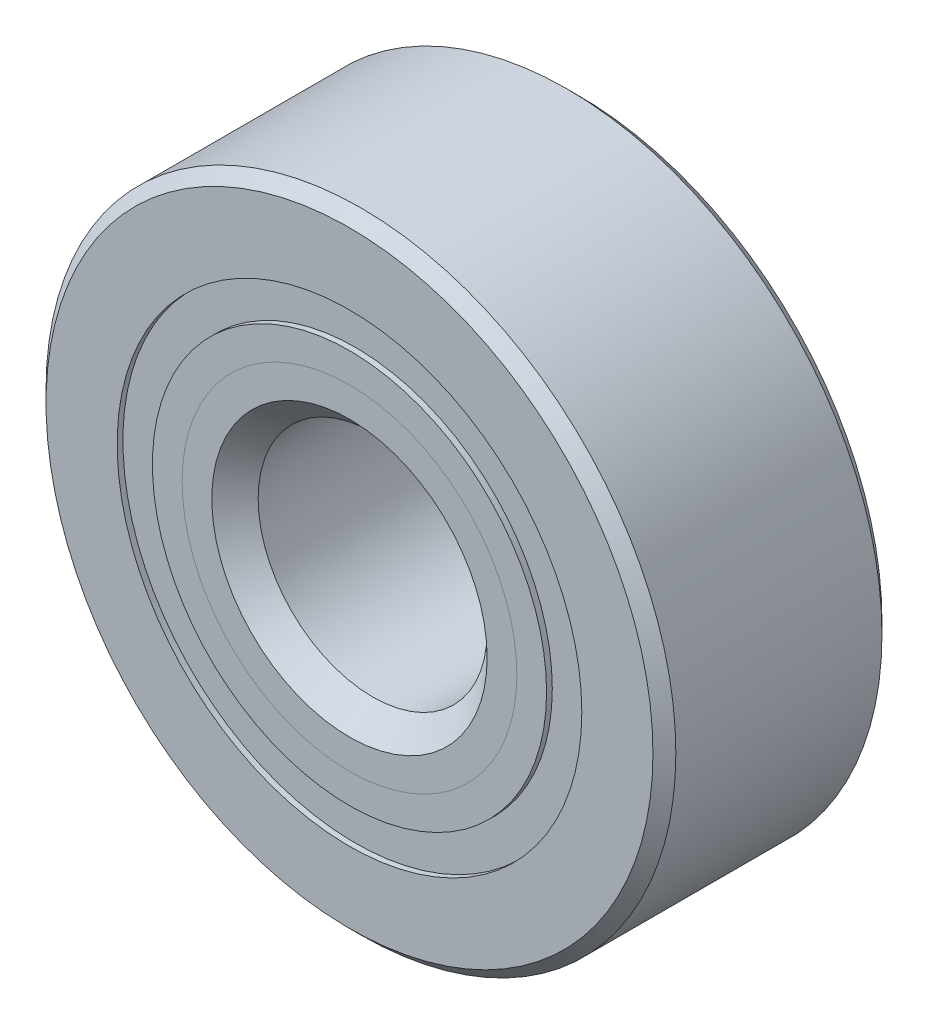
ISO-10303-21;
HEADER;
FILE_DESCRIPTION(('STEP AP214'),'2;1');
FILE_NAME('part.step','',(''),(''),'','','');
FILE_SCHEMA(('AUTOMOTIVE_DESIGN { 1 0 10303 214 1 1 1 1 }'));
ENDSEC;
DATA;
#1=APPLICATION_CONTEXT('core data for automotive mechanical design processes');
#2=APPLICATION_PROTOCOL_DEFINITION('international standard','automotive_design',2000,#1);
#3=PRODUCT_CONTEXT('',#1,'mechanical');
#4=PRODUCT('Part','Part','',(#3));
#5=PRODUCT_RELATED_PRODUCT_CATEGORY('part','',(#4));
#6=PRODUCT_DEFINITION_FORMATION('','',#4);
#7=PRODUCT_DEFINITION_CONTEXT('part definition',#1,'design');
#8=PRODUCT_DEFINITION('design','',#6,#7);
#9=PRODUCT_DEFINITION_SHAPE('','',#8);
#10=(LENGTH_UNIT() NAMED_UNIT(*) SI_UNIT(.MILLI.,.METRE.));
#11=(NAMED_UNIT(*) PLANE_ANGLE_UNIT() SI_UNIT($,.RADIAN.));
#12=(NAMED_UNIT(*) SI_UNIT($,.STERADIAN.) SOLID_ANGLE_UNIT());
#13=UNCERTAINTY_MEASURE_WITH_UNIT(LENGTH_MEASURE(1.E-05),#10,'distance_accuracy_value','');
#14=(GEOMETRIC_REPRESENTATION_CONTEXT(3) GLOBAL_UNCERTAINTY_ASSIGNED_CONTEXT((#13)) GLOBAL_UNIT_ASSIGNED_CONTEXT((#10,
#11,#12)) REPRESENTATION_CONTEXT('',''));
#15=CARTESIAN_POINT('',(0.,0.,0.));
#16=DIRECTION('',(0.,0.,1.));
#17=DIRECTION('',(1.,0.,0.));
#18=AXIS2_PLACEMENT_3D('',#15,#16,#17);
#19=CARTESIAN_POINT('',(0.,6.44158653846154,-3.01625000000001));
#20=DIRECTION('',(0.,0.,1.));
#21=DIRECTION('',(1.,0.,0.));
#22=AXIS2_PLACEMENT_3D('',#19,#20,#21);
#23=PLANE('',#22);
#24=CARTESIAN_POINT('',(0.,0.,-3.01625000000001));
#25=DIRECTION('',(0.,0.,1.));
#26=DIRECTION('',(1.,0.,0.));
#27=AXIS2_PLACEMENT_3D('',#24,#25,#26);
#28=CIRCLE('',#27,6.44158653846154);
#29=CARTESIAN_POINT('',(6.44158653846154,0.,-3.01625000000001));
#30=VERTEX_POINT('',#29);
#31=EDGE_CURVE('E57',#30,#30,#28,.T.);
#32=ORIENTED_EDGE('',*,*,#31,.F.);
#33=EDGE_LOOP('',(#32));
#34=FACE_BOUND('',#33,.T.);
#35=CARTESIAN_POINT('',(0.,0.,-3.01625000000001));
#36=DIRECTION('',(0.,0.,1.));
#37=DIRECTION('',(1.,0.,0.));
#38=AXIS2_PLACEMENT_3D('',#35,#36,#37);
#39=CIRCLE('',#38,5.46466346153846);
#40=CARTESIAN_POINT('',(5.46466346153846,0.,-3.01625000000001));
#41=VERTEX_POINT('',#40);
#42=EDGE_CURVE('E11',#41,#41,#39,.T.);
#43=ORIENTED_EDGE('',*,*,#42,.T.);
#44=EDGE_LOOP('',(#43));
#45=FACE_BOUND('',#44,.T.);
#46=ADVANCED_FACE('F43',(#34,#45),#23,.F.);
#47=CARTESIAN_POINT('',(0.,0.,3.175));
#48=DIRECTION('',(0.,0.,1.));
#49=DIRECTION('',(1.,0.,0.));
#50=AXIS2_PLACEMENT_3D('',#47,#48,#49);
#51=CYLINDRICAL_SURFACE('',#50,5.46466346153846);
#52=ORIENTED_EDGE('',*,*,#42,.F.);
#53=EDGE_LOOP('',(#52));
#54=FACE_BOUND('',#53,.T.);
#55=CARTESIAN_POINT('',(0.,0.,-1.4932612773582));
#56=DIRECTION('',(0.,0.,1.));
#57=DIRECTION('',(1.,0.,0.));
#58=AXIS2_PLACEMENT_3D('',#55,#56,#57);
#59=CIRCLE('',#58,5.46466346153846);
#60=CARTESIAN_POINT('',(5.46466346153846,0.,-1.4932612773582));
#61=VERTEX_POINT('',#60);
#62=EDGE_CURVE('E49',#61,#61,#59,.T.);
#63=ORIENTED_EDGE('',*,*,#62,.T.);
#64=EDGE_LOOP('',(#63));
#65=FACE_BOUND('',#64,.T.);
#66=ADVANCED_FACE('F66',(#54,#65),#51,.F.);
#67=CARTESIAN_POINT('',(0.,6.44158653846153,-1.4932612773582));
#68=DIRECTION('',(0.,0.,-1.));
#69=DIRECTION('',(-1.,0.,0.));
#70=AXIS2_PLACEMENT_3D('',#67,#68,#69);
#71=PLANE('',#70);
#72=ORIENTED_EDGE('',*,*,#62,.F.);
#73=EDGE_LOOP('',(#72));
#74=FACE_BOUND('',#73,.T.);
#75=CARTESIAN_POINT('',(0.,0.,-1.4932612773582));
#76=DIRECTION('',(0.,0.,1.));
#77=DIRECTION('',(1.,0.,0.));
#78=AXIS2_PLACEMENT_3D('',#75,#76,#77);
#79=CIRCLE('',#78,6.44158653846153);
#80=CARTESIAN_POINT('',(6.44158653846153,0.,-1.4932612773582));
#81=VERTEX_POINT('',#80);
#82=EDGE_CURVE('E53',#81,#81,#79,.T.);
#83=ORIENTED_EDGE('',*,*,#82,.T.);
#84=EDGE_LOOP('',(#83));
#85=FACE_BOUND('',#84,.T.);
#86=ADVANCED_FACE('F70',(#74,#85),#71,.F.);
#87=CARTESIAN_POINT('',(0.,0.,3.175));
#88=DIRECTION('',(0.,0.,1.));
#89=DIRECTION('',(1.,0.,0.));
#90=AXIS2_PLACEMENT_3D('',#87,#88,#89);
#91=CYLINDRICAL_SURFACE('',#90,6.44158653846154);
#92=ORIENTED_EDGE('',*,*,#82,.F.);
#93=EDGE_LOOP('',(#92));
#94=FACE_BOUND('',#93,.T.);
#95=ORIENTED_EDGE('',*,*,#31,.T.);
#96=EDGE_LOOP('',(#95));
#97=FACE_BOUND('',#96,.T.);
#98=ADVANCED_FACE('F63',(#94,#97),#91,.T.);
#99=CLOSED_SHELL('',(#46,#66,#86,#98));
#100=MANIFOLD_SOLID_BREP('B2',#99);
#101=CARTESIAN_POINT('',(0.,6.44158653846153,3.01625));
#102=DIRECTION('',(0.,0.,-1.));
#103=DIRECTION('',(-1.,0.,0.));
#104=AXIS2_PLACEMENT_3D('',#101,#102,#103);
#105=PLANE('',#104);
#106=CARTESIAN_POINT('',(0.,0.,3.01625));
#107=DIRECTION('',(0.,0.,1.));
#108=DIRECTION('',(1.,0.,0.));
#109=AXIS2_PLACEMENT_3D('',#106,#107,#108);
#110=CIRCLE('',#109,5.46466346153846);
#111=CARTESIAN_POINT('',(5.46466346153846,0.,3.01625));
#112=VERTEX_POINT('',#111);
#113=EDGE_CURVE('E42',#112,#112,#110,.T.);
#114=ORIENTED_EDGE('',*,*,#113,.F.);
#115=EDGE_LOOP('',(#114));
#116=FACE_BOUND('',#115,.T.);
#117=CARTESIAN_POINT('',(0.,0.,3.01625));
#118=DIRECTION('',(0.,0.,1.));
#119=DIRECTION('',(1.,0.,0.));
#120=AXIS2_PLACEMENT_3D('',#117,#118,#119);
#121=CIRCLE('',#120,6.44158653846153);
#122=CARTESIAN_POINT('',(6.44158653846153,0.,3.01625));
#123=VERTEX_POINT('',#122);
#124=EDGE_CURVE('E124',#123,#123,#121,.T.);
#125=ORIENTED_EDGE('',*,*,#124,.T.);
#126=EDGE_LOOP('',(#125));
#127=FACE_BOUND('',#126,.T.);
#128=ADVANCED_FACE('F110',(#116,#127),#105,.F.);
#129=CARTESIAN_POINT('',(0.,0.,3.175));
#130=DIRECTION('',(0.,0.,1.));
#131=DIRECTION('',(1.,0.,0.));
#132=AXIS2_PLACEMENT_3D('',#129,#130,#131);
#133=CYLINDRICAL_SURFACE('',#132,5.46466346153846);
#134=CARTESIAN_POINT('',(0.,0.,1.4932612773582));
#135=DIRECTION('',(0.,0.,1.));
#136=DIRECTION('',(1.,0.,0.));
#137=AXIS2_PLACEMENT_3D('',#134,#135,#136);
#138=CIRCLE('',#137,5.46466346153846);
#139=CARTESIAN_POINT('',(5.46466346153846,0.,1.4932612773582));
#140=VERTEX_POINT('',#139);
#141=EDGE_CURVE('E116',#140,#140,#138,.T.);
#142=ORIENTED_EDGE('',*,*,#141,.F.);
#143=EDGE_LOOP('',(#142));
#144=FACE_BOUND('',#143,.T.);
#145=ORIENTED_EDGE('',*,*,#113,.T.);
#146=EDGE_LOOP('',(#145));
#147=FACE_BOUND('',#146,.T.);
#148=ADVANCED_FACE('F139',(#144,#147),#133,.F.);
#149=CARTESIAN_POINT('',(0.,6.44158653846153,1.4932612773582));
#150=DIRECTION('',(0.,0.,1.));
#151=DIRECTION('',(1.,0.,0.));
#152=AXIS2_PLACEMENT_3D('',#149,#150,#151);
#153=PLANE('',#152);
#154=CARTESIAN_POINT('',(0.,0.,1.4932612773582));
#155=DIRECTION('',(0.,0.,1.));
#156=DIRECTION('',(1.,0.,0.));
#157=AXIS2_PLACEMENT_3D('',#154,#155,#156);
#158=CIRCLE('',#157,6.44158653846153);
#159=CARTESIAN_POINT('',(6.44158653846153,0.,1.4932612773582));
#160=VERTEX_POINT('',#159);
#161=EDGE_CURVE('E120',#160,#160,#158,.T.);
#162=ORIENTED_EDGE('',*,*,#161,.F.);
#163=EDGE_LOOP('',(#162));
#164=FACE_BOUND('',#163,.T.);
#165=ORIENTED_EDGE('',*,*,#141,.T.);
#166=EDGE_LOOP('',(#165));
#167=FACE_BOUND('',#166,.T.);
#168=ADVANCED_FACE('F134',(#164,#167),#153,.F.);
#169=CARTESIAN_POINT('',(0.,0.,3.175));
#170=DIRECTION('',(0.,0.,1.));
#171=DIRECTION('',(1.,0.,0.));
#172=AXIS2_PLACEMENT_3D('',#169,#170,#171);
#173=CYLINDRICAL_SURFACE('',#172,6.44158653846153);
#174=ORIENTED_EDGE('',*,*,#124,.F.);
#175=EDGE_LOOP('',(#174));
#176=FACE_BOUND('',#175,.T.);
#177=ORIENTED_EDGE('',*,*,#161,.T.);
#178=EDGE_LOOP('',(#177));
#179=FACE_BOUND('',#178,.T.);
#180=ADVANCED_FACE('F131',(#176,#179),#173,.T.);
#181=CLOSED_SHELL('',(#128,#148,#168,#180));
#182=MANIFOLD_SOLID_BREP('B6',#181);
#183=CARTESIAN_POINT('',(-4.20949505675111,4.20949505675122,0.));
#184=DIRECTION('',(0.,0.,1.));
#185=DIRECTION('',(-0.707106781186539,0.707106781186556,0.));
#186=AXIS2_PLACEMENT_3D('',#183,#184,#185);
#187=SPHERICAL_SURFACE('',#186,1.4932612773582);
#188=CARTESIAN_POINT('',(-4.20949505675111,4.20949505675122,1.4932612773582));
#189=VERTEX_POINT('',#188);
#190=VERTEX_LOOP('',#189);
#191=FACE_BOUND('',#190,.T.);
#192=ADVANCED_FACE('F177',(#191),#187,.T.);
#193=CLOSED_SHELL('',(#192));
#194=MANIFOLD_SOLID_BREP('B37',#193);
#195=CARTESIAN_POINT('',(-5.953125,0.,0.));
#196=DIRECTION('',(0.,0.,1.));
#197=DIRECTION('',(-1.,0.,0.));
#198=AXIS2_PLACEMENT_3D('',#195,#196,#197);
#199=SPHERICAL_SURFACE('',#198,1.4932612773582);
#200=CARTESIAN_POINT('',(-5.953125,0.,1.4932612773582));
#201=VERTEX_POINT('',#200);
#202=VERTEX_LOOP('',#201);
#203=FACE_BOUND('',#202,.T.);
#204=ADVANCED_FACE('F210',(#203),#199,.T.);
#205=CLOSED_SHELL('',(#204));
#206=MANIFOLD_SOLID_BREP('B106',#205);
#207=CARTESIAN_POINT('',(-4.2094950567512,-4.20949505675113,0.));
#208=DIRECTION('',(0.,0.,1.));
#209=DIRECTION('',(-0.707106781186554,-0.707106781186541,0.));
#210=AXIS2_PLACEMENT_3D('',#207,#208,#209);
#211=SPHERICAL_SURFACE('',#210,1.4932612773582);
#212=CARTESIAN_POINT('',(-4.2094950567512,-4.20949505675113,1.4932612773582));
#213=VERTEX_POINT('',#212);
#214=VERTEX_LOOP('',#213);
#215=FACE_BOUND('',#214,.T.);
#216=ADVANCED_FACE('F243',(#215),#211,.T.);
#217=CLOSED_SHELL('',(#216));
#218=MANIFOLD_SOLID_BREP('B173',#217);
#219=CARTESIAN_POINT('',(0.,-5.953125,0.));
#220=DIRECTION('',(0.,0.,1.));
#221=DIRECTION('',(0.,-1.,0.));
#222=AXIS2_PLACEMENT_3D('',#219,#220,#221);
#223=SPHERICAL_SURFACE('',#222,1.4932612773582);
#224=CARTESIAN_POINT('',(0.,-5.953125,1.4932612773582));
#225=VERTEX_POINT('',#224);
#226=VERTEX_LOOP('',#225);
#227=FACE_BOUND('',#226,.T.);
#228=ADVANCED_FACE('F274',(#227),#223,.T.);
#229=CLOSED_SHELL('',(#228));
#230=MANIFOLD_SOLID_BREP('B206',#229);
#231=CARTESIAN_POINT('',(4.20949505675114,-4.20949505675119,0.));
#232=DIRECTION('',(0.,0.,1.));
#233=DIRECTION('',(0.707106781186544,-0.707106781186551,0.));
#234=AXIS2_PLACEMENT_3D('',#231,#232,#233);
#235=SPHERICAL_SURFACE('',#234,1.4932612773582);
#236=CARTESIAN_POINT('',(4.20949505675114,-4.20949505675119,1.4932612773582));
#237=VERTEX_POINT('',#236);
#238=VERTEX_LOOP('',#237);
#239=FACE_BOUND('',#238,.T.);
#240=ADVANCED_FACE('F307',(#239),#235,.T.);
#241=CLOSED_SHELL('',(#240));
#242=MANIFOLD_SOLID_BREP('B239',#241);
#243=CARTESIAN_POINT('',(5.953125,0.,0.));
#244=DIRECTION('',(0.,0.,1.));
#245=DIRECTION('',(1.,0.,0.));
#246=AXIS2_PLACEMENT_3D('',#243,#244,#245);
#247=SPHERICAL_SURFACE('',#246,1.4932612773582);
#248=CARTESIAN_POINT('',(5.953125,0.,1.4932612773582));
#249=VERTEX_POINT('',#248);
#250=VERTEX_LOOP('',#249);
#251=FACE_BOUND('',#250,.T.);
#252=ADVANCED_FACE('F340',(#251),#247,.T.);
#253=CLOSED_SHELL('',(#252));
#254=MANIFOLD_SOLID_BREP('B270',#253);
#255=CARTESIAN_POINT('',(4.20949505675117,4.20949505675116,0.));
#256=DIRECTION('',(0.,0.,1.));
#257=DIRECTION('',(0.707106781186549,0.707106781186546,0.));
#258=AXIS2_PLACEMENT_3D('',#255,#256,#257);
#259=SPHERICAL_SURFACE('',#258,1.4932612773582);
#260=CARTESIAN_POINT('',(4.20949505675117,4.20949505675116,1.4932612773582));
#261=VERTEX_POINT('',#260);
#262=VERTEX_LOOP('',#261);
#263=FACE_BOUND('',#262,.T.);
#264=ADVANCED_FACE('F373',(#263),#259,.T.);
#265=CLOSED_SHELL('',(#264));
#266=MANIFOLD_SOLID_BREP('B303',#265);
#267=CARTESIAN_POINT('',(0.,5.953125,0.));
#268=DIRECTION('',(0.,0.,1.));
#269=DIRECTION('',(0.,1.,0.));
#270=AXIS2_PLACEMENT_3D('',#267,#268,#269);
#271=SPHERICAL_SURFACE('',#270,1.4932612773582);
#272=CARTESIAN_POINT('',(0.,5.953125,1.4932612773582));
#273=VERTEX_POINT('',#272);
#274=VERTEX_LOOP('',#273);
#275=FACE_BOUND('',#274,.T.);
#276=ADVANCED_FACE('F406',(#275),#271,.T.);
#277=CLOSED_SHELL('',(#276));
#278=MANIFOLD_SOLID_BREP('B336',#277);
#279=CARTESIAN_POINT('',(0.,4.64104766142968,3.175));
#280=DIRECTION('',(0.,0.,-1.));
#281=DIRECTION('',(-1.,0.,0.));
#282=AXIS2_PLACEMENT_3D('',#279,#280,#281);
#283=PLANE('',#282);
#284=CARTESIAN_POINT('',(0.,0.,3.175));
#285=DIRECTION('',(0.,0.,1.));
#286=DIRECTION('',(1.,0.,0.));
#287=AXIS2_PLACEMENT_3D('',#284,#285,#286);
#288=CIRCLE('',#287,3.8174318613209);
#289=CARTESIAN_POINT('',(3.8174318613209,0.,3.175));
#290=VERTEX_POINT('',#289);
#291=EDGE_CURVE('E460',#290,#290,#288,.T.);
#292=ORIENTED_EDGE('',*,*,#291,.F.);
#293=EDGE_LOOP('',(#292));
#294=FACE_BOUND('',#293,.T.);
#295=CARTESIAN_POINT('',(0.,0.,3.175));
#296=DIRECTION('',(0.,0.,1.));
#297=DIRECTION('',(1.,0.,0.));
#298=AXIS2_PLACEMENT_3D('',#295,#296,#297);
#299=CIRCLE('',#298,4.64104766142968);
#300=CARTESIAN_POINT('',(4.64104766142968,0.,3.175));
#301=VERTEX_POINT('',#300);
#302=EDGE_CURVE('E405',#301,#301,#299,.T.);
#303=ORIENTED_EDGE('',*,*,#302,.T.);
#304=EDGE_LOOP('',(#303));
#305=FACE_BOUND('',#304,.T.);
#306=ADVANCED_FACE('F426',(#294,#305),#283,.F.);
#307=CARTESIAN_POINT('',(0.,0.,2.35138419989122));
#308=DIRECTION('',(0.,0.,1.));
#309=DIRECTION('',(1.,0.,0.));
#310=AXIS2_PLACEMENT_3D('',#307,#308,#309);
#311=CONICAL_SURFACE('',#310,3.8174318613209,0.78539816339745);
#312=ORIENTED_EDGE('',*,*,#302,.F.);
#313=EDGE_LOOP('',(#312));
#314=FACE_BOUND('',#313,.T.);
#315=CARTESIAN_POINT('',(0.,0.,2.35138419989122));
#316=DIRECTION('',(0.,0.,1.));
#317=DIRECTION('',(1.,0.,0.));
#318=AXIS2_PLACEMENT_3D('',#315,#316,#317);
#319=CIRCLE('',#318,3.8174318613209);
#320=CARTESIAN_POINT('',(3.8174318613209,0.,2.35138419989122));
#321=VERTEX_POINT('',#320);
#322=EDGE_CURVE('E432',#321,#321,#319,.T.);
#323=ORIENTED_EDGE('',*,*,#322,.T.);
#324=EDGE_LOOP('',(#323));
#325=FACE_BOUND('',#324,.T.);
#326=ADVANCED_FACE('F467',(#314,#325),#311,.T.);
#327=CARTESIAN_POINT('',(0.,0.,3.175));
#328=DIRECTION('',(0.,0.,1.));
#329=DIRECTION('',(1.,0.,0.));
#330=AXIS2_PLACEMENT_3D('',#327,#328,#329);
#331=CYLINDRICAL_SURFACE('',#330,3.8174318613209);
#332=ORIENTED_EDGE('',*,*,#322,.F.);
#333=EDGE_LOOP('',(#332));
#334=FACE_BOUND('',#333,.T.);
#335=CARTESIAN_POINT('',(0.,0.,0.));
#336=DIRECTION('',(0.,0.,1.));
#337=DIRECTION('',(1.,0.,0.));
#338=AXIS2_PLACEMENT_3D('',#335,#336,#337);
#339=CIRCLE('',#338,3.8174318613209);
#340=CARTESIAN_POINT('',(3.8174318613209,0.,0.));
#341=VERTEX_POINT('',#340);
#342=EDGE_CURVE('E436',#341,#341,#339,.T.);
#343=ORIENTED_EDGE('',*,*,#342,.T.);
#344=EDGE_LOOP('',(#343));
#345=FACE_BOUND('',#344,.T.);
#346=ADVANCED_FACE('F471',(#334,#345),#331,.T.);
#347=CARTESIAN_POINT('',(0.,3.8174318613209,0.));
#348=DIRECTION('',(0.,0.,-1.));
#349=DIRECTION('',(-1.,0.,0.));
#350=AXIS2_PLACEMENT_3D('',#347,#348,#349);
#351=PLANE('',#350);
#352=ORIENTED_EDGE('',*,*,#342,.F.);
#353=EDGE_LOOP('',(#352));
#354=FACE_BOUND('',#353,.T.);
#355=CARTESIAN_POINT('',(0.,0.,0.));
#356=DIRECTION('',(0.,0.,1.));
#357=DIRECTION('',(1.,0.,0.));
#358=AXIS2_PLACEMENT_3D('',#355,#356,#357);
#359=CIRCLE('',#358,4.4598637226418);
#360=CARTESIAN_POINT('',(4.4598637226418,0.,0.));
#361=VERTEX_POINT('',#360);
#362=EDGE_CURVE('E440',#361,#361,#359,.T.);
#363=ORIENTED_EDGE('',*,*,#362,.T.);
#364=EDGE_LOOP('',(#363));
#365=FACE_BOUND('',#364,.T.);
#366=ADVANCED_FACE('F476',(#354,#365),#351,.F.);
#367=CARTESIAN_POINT('',(0.,0.,0.));
#368=DIRECTION('',(0.,0.,1.));
#369=DIRECTION('',(1.,0.,0.));
#370=AXIS2_PLACEMENT_3D('',#367,#368,#369);
#371=TOROIDAL_SURFACE('',#370,5.953125,1.4932612773582);
#372=ORIENTED_EDGE('',*,*,#362,.F.);
#373=EDGE_LOOP('',(#372));
#374=FACE_BOUND('',#373,.T.);
#375=CARTESIAN_POINT('',(0.,0.,-1.41111111111111));
#376=DIRECTION('',(0.,0.,1.));
#377=DIRECTION('',(1.,0.,0.));
#378=AXIS2_PLACEMENT_3D('',#375,#376,#377);
#379=CIRCLE('',#378,5.46466346153846);
#380=CARTESIAN_POINT('',(5.46466346153846,0.,-1.41111111111111));
#381=VERTEX_POINT('',#380);
#382=EDGE_CURVE('E445',#381,#381,#379,.T.);
#383=ORIENTED_EDGE('',*,*,#382,.T.);
#384=EDGE_LOOP('',(#383));
#385=FACE_BOUND('',#384,.T.);
#386=ADVANCED_FACE('F482',(#374,#385),#371,.F.);
#387=CARTESIAN_POINT('',(0.,0.,3.175));
#388=DIRECTION('',(0.,0.,1.));
#389=DIRECTION('',(1.,0.,0.));
#390=AXIS2_PLACEMENT_3D('',#387,#388,#389);
#391=CYLINDRICAL_SURFACE('',#390,5.46466346153846);
#392=ORIENTED_EDGE('',*,*,#382,.F.);
#393=EDGE_LOOP('',(#392));
#394=FACE_BOUND('',#393,.T.);
#395=CARTESIAN_POINT('',(0.,0.,-3.175));
#396=DIRECTION('',(0.,0.,1.));
#397=DIRECTION('',(1.,0.,0.));
#398=AXIS2_PLACEMENT_3D('',#395,#396,#397);
#399=CIRCLE('',#398,5.46466346153846);
#400=CARTESIAN_POINT('',(5.46466346153846,0.,-3.175));
#401=VERTEX_POINT('',#400);
#402=EDGE_CURVE('E448',#401,#401,#399,.T.);
#403=ORIENTED_EDGE('',*,*,#402,.T.);
#404=EDGE_LOOP('',(#403));
#405=FACE_BOUND('',#404,.T.);
#406=ADVANCED_FACE('F486',(#394,#405),#391,.T.);
#407=CARTESIAN_POINT('',(0.,3.4925,-3.175));
#408=DIRECTION('',(0.,0.,1.));
#409=DIRECTION('',(1.,0.,0.));
#410=AXIS2_PLACEMENT_3D('',#407,#408,#409);
#411=PLANE('',#410);
#412=ORIENTED_EDGE('',*,*,#402,.F.);
#413=EDGE_LOOP('',(#412));
#414=FACE_BOUND('',#413,.T.);
#415=CARTESIAN_POINT('',(0.,0.,-3.175));
#416=DIRECTION('',(0.,0.,1.));
#417=DIRECTION('',(1.,0.,0.));
#418=AXIS2_PLACEMENT_3D('',#415,#416,#417);
#419=CIRCLE('',#418,3.4925);
#420=CARTESIAN_POINT('',(3.4925,0.,-3.175));
#421=VERTEX_POINT('',#420);
#422=EDGE_CURVE('E451',#421,#421,#419,.T.);
#423=ORIENTED_EDGE('',*,*,#422,.T.);
#424=EDGE_LOOP('',(#423));
#425=FACE_BOUND('',#424,.T.);
#426=ADVANCED_FACE('F490',(#414,#425),#411,.F.);
#427=CARTESIAN_POINT('',(0.,0.,-2.8575));
#428=DIRECTION('',(0.,0.,-1.));
#429=DIRECTION('',(-1.,0.,0.));
#430=AXIS2_PLACEMENT_3D('',#427,#428,#429);
#431=CONICAL_SURFACE('',#430,3.175,0.78539816339745);
#432=ORIENTED_EDGE('',*,*,#422,.F.);
#433=EDGE_LOOP('',(#432));
#434=FACE_BOUND('',#433,.T.);
#435=CARTESIAN_POINT('',(0.,0.,-2.8575));
#436=DIRECTION('',(0.,0.,1.));
#437=DIRECTION('',(1.,0.,0.));
#438=AXIS2_PLACEMENT_3D('',#435,#436,#437);
#439=CIRCLE('',#438,3.175);
#440=CARTESIAN_POINT('',(3.175,0.,-2.8575));
#441=VERTEX_POINT('',#440);
#442=EDGE_CURVE('E454',#441,#441,#439,.T.);
#443=ORIENTED_EDGE('',*,*,#442,.T.);
#444=EDGE_LOOP('',(#443));
#445=FACE_BOUND('',#444,.T.);
#446=ADVANCED_FACE('F494',(#434,#445),#431,.F.);
#447=CARTESIAN_POINT('',(0.,0.,3.175));
#448=DIRECTION('',(0.,0.,1.));
#449=DIRECTION('',(1.,0.,0.));
#450=AXIS2_PLACEMENT_3D('',#447,#448,#449);
#451=CYLINDRICAL_SURFACE('',#450,3.175);
#452=ORIENTED_EDGE('',*,*,#442,.F.);
#453=EDGE_LOOP('',(#452));
#454=FACE_BOUND('',#453,.T.);
#455=CARTESIAN_POINT('',(0.,0.,2.5325681386791));
#456=DIRECTION('',(0.,0.,1.));
#457=DIRECTION('',(1.,0.,0.));
#458=AXIS2_PLACEMENT_3D('',#455,#456,#457);
#459=CIRCLE('',#458,3.175);
#460=CARTESIAN_POINT('',(3.175,0.,2.5325681386791));
#461=VERTEX_POINT('',#460);
#462=EDGE_CURVE('E457',#461,#461,#459,.T.);
#463=ORIENTED_EDGE('',*,*,#462,.T.);
#464=EDGE_LOOP('',(#463));
#465=FACE_BOUND('',#464,.T.);
#466=ADVANCED_FACE('F498',(#454,#465),#451,.F.);
#467=CARTESIAN_POINT('',(0.,0.,3.175));
#468=DIRECTION('',(0.,0.,1.));
#469=DIRECTION('',(1.,0.,0.));
#470=AXIS2_PLACEMENT_3D('',#467,#468,#469);
#471=CONICAL_SURFACE('',#470,3.8174318613209,0.78539816339745);
#472=ORIENTED_EDGE('',*,*,#462,.F.);
#473=EDGE_LOOP('',(#472));
#474=FACE_BOUND('',#473,.T.);
#475=ORIENTED_EDGE('',*,*,#291,.T.);
#476=EDGE_LOOP('',(#475));
#477=FACE_BOUND('',#476,.T.);
#478=ADVANCED_FACE('F464',(#474,#477),#471,.F.);
#479=CLOSED_SHELL('',(#306,#326,#346,#366,#386,#406,#426,#446,#466,#478));
#480=MANIFOLD_SOLID_BREP('B369',#479);
#481=CARTESIAN_POINT('',(0.,5.46466346153846,3.175));
#482=DIRECTION('',(0.,0.,-1.));
#483=DIRECTION('',(-1.,0.,0.));
#484=AXIS2_PLACEMENT_3D('',#481,#482,#483);
#485=PLANE('',#484);
#486=CARTESIAN_POINT('',(0.,0.,3.175));
#487=DIRECTION('',(0.,0.,1.));
#488=DIRECTION('',(1.,0.,0.));
#489=AXIS2_PLACEMENT_3D('',#486,#487,#488);
#490=CIRCLE('',#489,4.64104766142968);
#491=CARTESIAN_POINT('',(4.64104766142968,0.,3.175));
#492=VERTEX_POINT('',#491);
#493=EDGE_CURVE('E425',#492,#492,#490,.T.);
#494=ORIENTED_EDGE('',*,*,#493,.F.);
#495=EDGE_LOOP('',(#494));
#496=FACE_BOUND('',#495,.T.);
#497=CARTESIAN_POINT('',(0.,0.,3.175));
#498=DIRECTION('',(0.,0.,1.));
#499=DIRECTION('',(1.,0.,0.));
#500=AXIS2_PLACEMENT_3D('',#497,#498,#499);
#501=CIRCLE('',#500,5.46466346153846);
#502=CARTESIAN_POINT('',(5.46466346153846,0.,3.175));
#503=VERTEX_POINT('',#502);
#504=EDGE_CURVE('E606',#503,#503,#501,.T.);
#505=ORIENTED_EDGE('',*,*,#504,.T.);
#506=EDGE_LOOP('',(#505));
#507=FACE_BOUND('',#506,.T.);
#508=ADVANCED_FACE('F584',(#496,#507),#485,.F.);
#509=CARTESIAN_POINT('',(0.,0.,3.175));
#510=DIRECTION('',(0.,0.,1.));
#511=DIRECTION('',(1.,0.,0.));
#512=AXIS2_PLACEMENT_3D('',#509,#510,#511);
#513=CONICAL_SURFACE('',#512,4.64104766142968,0.78539816339745);
#514=CARTESIAN_POINT('',(0.,0.,2.35138419989122));
#515=DIRECTION('',(0.,0.,1.));
#516=DIRECTION('',(1.,0.,0.));
#517=AXIS2_PLACEMENT_3D('',#514,#515,#516);
#518=CIRCLE('',#517,3.8174318613209);
#519=CARTESIAN_POINT('',(3.8174318613209,0.,2.35138419989122));
#520=VERTEX_POINT('',#519);
#521=EDGE_CURVE('E590',#520,#520,#518,.T.);
#522=ORIENTED_EDGE('',*,*,#521,.F.);
#523=EDGE_LOOP('',(#522));
#524=FACE_BOUND('',#523,.T.);
#525=ORIENTED_EDGE('',*,*,#493,.T.);
#526=EDGE_LOOP('',(#525));
#527=FACE_BOUND('',#526,.T.);
#528=ADVANCED_FACE('F631',(#524,#527),#513,.F.);
#529=CARTESIAN_POINT('',(0.,0.,3.175));
#530=DIRECTION('',(0.,0.,1.));
#531=DIRECTION('',(1.,0.,0.));
#532=AXIS2_PLACEMENT_3D('',#529,#530,#531);
#533=CYLINDRICAL_SURFACE('',#532,3.8174318613209);
#534=CARTESIAN_POINT('',(0.,0.,0.));
#535=DIRECTION('',(0.,0.,1.));
#536=DIRECTION('',(1.,0.,0.));
#537=AXIS2_PLACEMENT_3D('',#534,#535,#536);
#538=CIRCLE('',#537,3.8174318613209);
#539=CARTESIAN_POINT('',(3.8174318613209,0.,0.));
#540=VERTEX_POINT('',#539);
#541=EDGE_CURVE('E594',#540,#540,#538,.T.);
#542=ORIENTED_EDGE('',*,*,#541,.F.);
#543=EDGE_LOOP('',(#542));
#544=FACE_BOUND('',#543,.T.);
#545=ORIENTED_EDGE('',*,*,#521,.T.);
#546=EDGE_LOOP('',(#545));
#547=FACE_BOUND('',#546,.T.);
#548=ADVANCED_FACE('F626',(#544,#547),#533,.F.);
#549=CARTESIAN_POINT('',(0.,3.8174318613209,0.));
#550=DIRECTION('',(0.,0.,1.));
#551=DIRECTION('',(1.,0.,0.));
#552=AXIS2_PLACEMENT_3D('',#549,#550,#551);
#553=PLANE('',#552);
#554=CARTESIAN_POINT('',(0.,0.,0.));
#555=DIRECTION('',(0.,0.,1.));
#556=DIRECTION('',(1.,0.,0.));
#557=AXIS2_PLACEMENT_3D('',#554,#555,#556);
#558=CIRCLE('',#557,4.4598637226418);
#559=CARTESIAN_POINT('',(4.4598637226418,0.,0.));
#560=VERTEX_POINT('',#559);
#561=EDGE_CURVE('E598',#560,#560,#558,.T.);
#562=ORIENTED_EDGE('',*,*,#561,.F.);
#563=EDGE_LOOP('',(#562));
#564=FACE_BOUND('',#563,.T.);
#565=ORIENTED_EDGE('',*,*,#541,.T.);
#566=EDGE_LOOP('',(#565));
#567=FACE_BOUND('',#566,.T.);
#568=ADVANCED_FACE('F620',(#564,#567),#553,.F.);
#569=CARTESIAN_POINT('',(0.,0.,0.));
#570=DIRECTION('',(0.,0.,1.));
#571=DIRECTION('',(1.,0.,0.));
#572=AXIS2_PLACEMENT_3D('',#569,#570,#571);
#573=TOROIDAL_SURFACE('',#572,5.953125,1.4932612773582);
#574=CARTESIAN_POINT('',(0.,0.,1.41111111111111));
#575=DIRECTION('',(0.,0.,1.));
#576=DIRECTION('',(1.,0.,0.));
#577=AXIS2_PLACEMENT_3D('',#574,#575,#576);
#578=CIRCLE('',#577,5.46466346153846);
#579=CARTESIAN_POINT('',(5.46466346153846,0.,1.41111111111111));
#580=VERTEX_POINT('',#579);
#581=EDGE_CURVE('E603',#580,#580,#578,.T.);
#582=ORIENTED_EDGE('',*,*,#581,.F.);
#583=EDGE_LOOP('',(#582));
#584=FACE_BOUND('',#583,.T.);
#585=ORIENTED_EDGE('',*,*,#561,.T.);
#586=EDGE_LOOP('',(#585));
#587=FACE_BOUND('',#586,.T.);
#588=ADVANCED_FACE('F614',(#584,#587),#573,.F.);
#589=CARTESIAN_POINT('',(0.,0.,3.175));
#590=DIRECTION('',(0.,0.,1.));
#591=DIRECTION('',(1.,0.,0.));
#592=AXIS2_PLACEMENT_3D('',#589,#590,#591);
#593=CYLINDRICAL_SURFACE('',#592,5.46466346153846);
#594=ORIENTED_EDGE('',*,*,#504,.F.);
#595=EDGE_LOOP('',(#594));
#596=FACE_BOUND('',#595,.T.);
#597=ORIENTED_EDGE('',*,*,#581,.T.);
#598=EDGE_LOOP('',(#597));
#599=FACE_BOUND('',#598,.T.);
#600=ADVANCED_FACE('F611',(#596,#599),#593,.T.);
#601=CLOSED_SHELL('',(#508,#528,#548,#568,#588,#600));
#602=MANIFOLD_SOLID_BREP('B400',#601);
#603=CARTESIAN_POINT('',(0.,0.,2.8575));
#604=DIRECTION('',(0.,0.,-1.));
#605=DIRECTION('',(-1.,0.,0.));
#606=AXIS2_PLACEMENT_3D('',#603,#604,#605);
#607=CONICAL_SURFACE('',#606,8.73125,0.785398163397449);
#608=CARTESIAN_POINT('',(0.,0.,3.175));
#609=DIRECTION('',(0.,0.,1.));
#610=DIRECTION('',(1.,0.,0.));
#611=AXIS2_PLACEMENT_3D('',#608,#609,#610);
#612=CIRCLE('',#611,8.41375);
#613=CARTESIAN_POINT('',(8.41375,0.,3.175));
#614=VERTEX_POINT('',#613);
#615=EDGE_CURVE('E703',#614,#614,#612,.T.);
#616=ORIENTED_EDGE('',*,*,#615,.F.);
#617=EDGE_LOOP('',(#616));
#618=FACE_BOUND('',#617,.T.);
#619=CARTESIAN_POINT('',(0.,0.,2.8575));
#620=DIRECTION('',(0.,0.,1.));
#621=DIRECTION('',(1.,0.,0.));
#622=AXIS2_PLACEMENT_3D('',#619,#620,#621);
#623=CIRCLE('',#622,8.73125);
#624=CARTESIAN_POINT('',(8.73125,0.,2.8575));
#625=VERTEX_POINT('',#624);
#626=EDGE_CURVE('E583',#625,#625,#623,.T.);
#627=ORIENTED_EDGE('',*,*,#626,.T.);
#628=EDGE_LOOP('',(#627));
#629=FACE_BOUND('',#628,.T.);
#630=ADVANCED_FACE('F675',(#618,#629),#607,.T.);
#631=CARTESIAN_POINT('',(0.,0.,3.175));
#632=DIRECTION('',(0.,0.,1.));
#633=DIRECTION('',(1.,0.,0.));
#634=AXIS2_PLACEMENT_3D('',#631,#632,#633);
#635=CYLINDRICAL_SURFACE('',#634,8.73125);
#636=ORIENTED_EDGE('',*,*,#626,.F.);
#637=EDGE_LOOP('',(#636));
#638=FACE_BOUND('',#637,.T.);
#639=CARTESIAN_POINT('',(0.,0.,-2.8575));
#640=DIRECTION('',(0.,0.,1.));
#641=DIRECTION('',(1.,0.,0.));
#642=AXIS2_PLACEMENT_3D('',#639,#640,#641);
#643=CIRCLE('',#642,8.73125);
#644=CARTESIAN_POINT('',(8.73125,0.,-2.8575));
#645=VERTEX_POINT('',#644);
#646=EDGE_CURVE('E681',#645,#645,#643,.T.);
#647=ORIENTED_EDGE('',*,*,#646,.T.);
#648=EDGE_LOOP('',(#647));
#649=FACE_BOUND('',#648,.T.);
#650=ADVANCED_FACE('F710',(#638,#649),#635,.T.);
#651=CARTESIAN_POINT('',(0.,0.,-3.175));
#652=DIRECTION('',(0.,0.,1.));
#653=DIRECTION('',(1.,0.,0.));
#654=AXIS2_PLACEMENT_3D('',#651,#652,#653);
#655=CONICAL_SURFACE('',#654,8.41375,0.78539816339745);
#656=ORIENTED_EDGE('',*,*,#646,.F.);
#657=EDGE_LOOP('',(#656));
#658=FACE_BOUND('',#657,.T.);
#659=CARTESIAN_POINT('',(0.,0.,-3.175));
#660=DIRECTION('',(0.,0.,1.));
#661=DIRECTION('',(1.,0.,0.));
#662=AXIS2_PLACEMENT_3D('',#659,#660,#661);
#663=CIRCLE('',#662,8.41375);
#664=CARTESIAN_POINT('',(8.41375,0.,-3.175));
#665=VERTEX_POINT('',#664);
#666=EDGE_CURVE('E685',#665,#665,#663,.T.);
#667=ORIENTED_EDGE('',*,*,#666,.T.);
#668=EDGE_LOOP('',(#667));
#669=FACE_BOUND('',#668,.T.);
#670=ADVANCED_FACE('F714',(#658,#669),#655,.T.);
#671=CARTESIAN_POINT('',(0.,8.41375,-3.175));
#672=DIRECTION('',(0.,0.,1.));
#673=DIRECTION('',(1.,0.,0.));
#674=AXIS2_PLACEMENT_3D('',#671,#672,#673);
#675=PLANE('',#674);
#676=ORIENTED_EDGE('',*,*,#666,.F.);
#677=EDGE_LOOP('',(#676));
#678=FACE_BOUND('',#677,.T.);
#679=CARTESIAN_POINT('',(0.,0.,-3.175));
#680=DIRECTION('',(0.,0.,1.));
#681=DIRECTION('',(1.,0.,0.));
#682=AXIS2_PLACEMENT_3D('',#679,#680,#681);
#683=CIRCLE('',#682,6.44158653846154);
#684=CARTESIAN_POINT('',(6.44158653846154,0.,-3.175));
#685=VERTEX_POINT('',#684);
#686=EDGE_CURVE('E689',#685,#685,#683,.T.);
#687=ORIENTED_EDGE('',*,*,#686,.T.);
#688=EDGE_LOOP('',(#687));
#689=FACE_BOUND('',#688,.T.);
#690=ADVANCED_FACE('F719',(#678,#689),#675,.F.);
#691=CARTESIAN_POINT('',(0.,0.,3.175));
#692=DIRECTION('',(0.,0.,1.));
#693=DIRECTION('',(1.,0.,0.));
#694=AXIS2_PLACEMENT_3D('',#691,#692,#693);
#695=CYLINDRICAL_SURFACE('',#694,6.44158653846154);
#696=ORIENTED_EDGE('',*,*,#686,.F.);
#697=EDGE_LOOP('',(#696));
#698=FACE_BOUND('',#697,.T.);
#699=CARTESIAN_POINT('',(0.,0.,-1.41111111111111));
#700=DIRECTION('',(0.,0.,1.));
#701=DIRECTION('',(1.,0.,0.));
#702=AXIS2_PLACEMENT_3D('',#699,#700,#701);
#703=CIRCLE('',#702,6.44158653846153);
#704=CARTESIAN_POINT('',(6.44158653846153,0.,-1.41111111111111));
#705=VERTEX_POINT('',#704);
#706=EDGE_CURVE('E694',#705,#705,#703,.T.);
#707=ORIENTED_EDGE('',*,*,#706,.T.);
#708=EDGE_LOOP('',(#707));
#709=FACE_BOUND('',#708,.T.);
#710=ADVANCED_FACE('F725',(#698,#709),#695,.F.);
#711=CARTESIAN_POINT('',(0.,0.,0.));
#712=DIRECTION('',(0.,0.,1.));
#713=DIRECTION('',(1.,0.,0.));
#714=AXIS2_PLACEMENT_3D('',#711,#712,#713);
#715=TOROIDAL_SURFACE('',#714,5.953125,1.4932612773582);
#716=ORIENTED_EDGE('',*,*,#706,.F.);
#717=EDGE_LOOP('',(#716));
#718=FACE_BOUND('',#717,.T.);
#719=CARTESIAN_POINT('',(0.,0.,1.41111111111111));
#720=DIRECTION('',(0.,0.,1.));
#721=DIRECTION('',(1.,0.,0.));
#722=AXIS2_PLACEMENT_3D('',#719,#720,#721);
#723=CIRCLE('',#722,6.44158653846153);
#724=CARTESIAN_POINT('',(6.44158653846153,0.,1.41111111111111));
#725=VERTEX_POINT('',#724);
#726=EDGE_CURVE('E697',#725,#725,#723,.T.);
#727=ORIENTED_EDGE('',*,*,#726,.T.);
#728=EDGE_LOOP('',(#727));
#729=FACE_BOUND('',#728,.T.);
#730=ADVANCED_FACE('F729',(#718,#729),#715,.F.);
#731=CARTESIAN_POINT('',(0.,0.,3.175));
#732=DIRECTION('',(0.,0.,1.));
#733=DIRECTION('',(1.,0.,0.));
#734=AXIS2_PLACEMENT_3D('',#731,#732,#733);
#735=CYLINDRICAL_SURFACE('',#734,6.44158653846153);
#736=ORIENTED_EDGE('',*,*,#726,.F.);
#737=EDGE_LOOP('',(#736));
#738=FACE_BOUND('',#737,.T.);
#739=CARTESIAN_POINT('',(0.,0.,3.175));
#740=DIRECTION('',(0.,0.,1.));
#741=DIRECTION('',(1.,0.,0.));
#742=AXIS2_PLACEMENT_3D('',#739,#740,#741);
#743=CIRCLE('',#742,6.44158653846153);
#744=CARTESIAN_POINT('',(6.44158653846153,0.,3.175));
#745=VERTEX_POINT('',#744);
#746=EDGE_CURVE('E700',#745,#745,#743,.T.);
#747=ORIENTED_EDGE('',*,*,#746,.T.);
#748=EDGE_LOOP('',(#747));
#749=FACE_BOUND('',#748,.T.);
#750=ADVANCED_FACE('F733',(#738,#749),#735,.F.);
#751=CARTESIAN_POINT('',(0.,8.41375,3.175));
#752=DIRECTION('',(0.,0.,-1.));
#753=DIRECTION('',(-1.,0.,0.));
#754=AXIS2_PLACEMENT_3D('',#751,#752,#753);
#755=PLANE('',#754);
#756=ORIENTED_EDGE('',*,*,#746,.F.);
#757=EDGE_LOOP('',(#756));
#758=FACE_BOUND('',#757,.T.);
#759=ORIENTED_EDGE('',*,*,#615,.T.);
#760=EDGE_LOOP('',(#759));
#761=FACE_BOUND('',#760,.T.);
#762=ADVANCED_FACE('F707',(#758,#761),#755,.F.);
#763=CLOSED_SHELL('',(#630,#650,#670,#690,#710,#730,#750,#762));
#764=MANIFOLD_SOLID_BREP('B420',#763);
#765=ADVANCED_BREP_SHAPE_REPRESENTATION('',(#18,#100,#182,#194,#206,#218,#230,#242,#254,#266,
#278,#480,#602,#764),#14);
#766=SHAPE_DEFINITION_REPRESENTATION(#9,#765);
ENDSEC;
END-ISO-10303-21;
